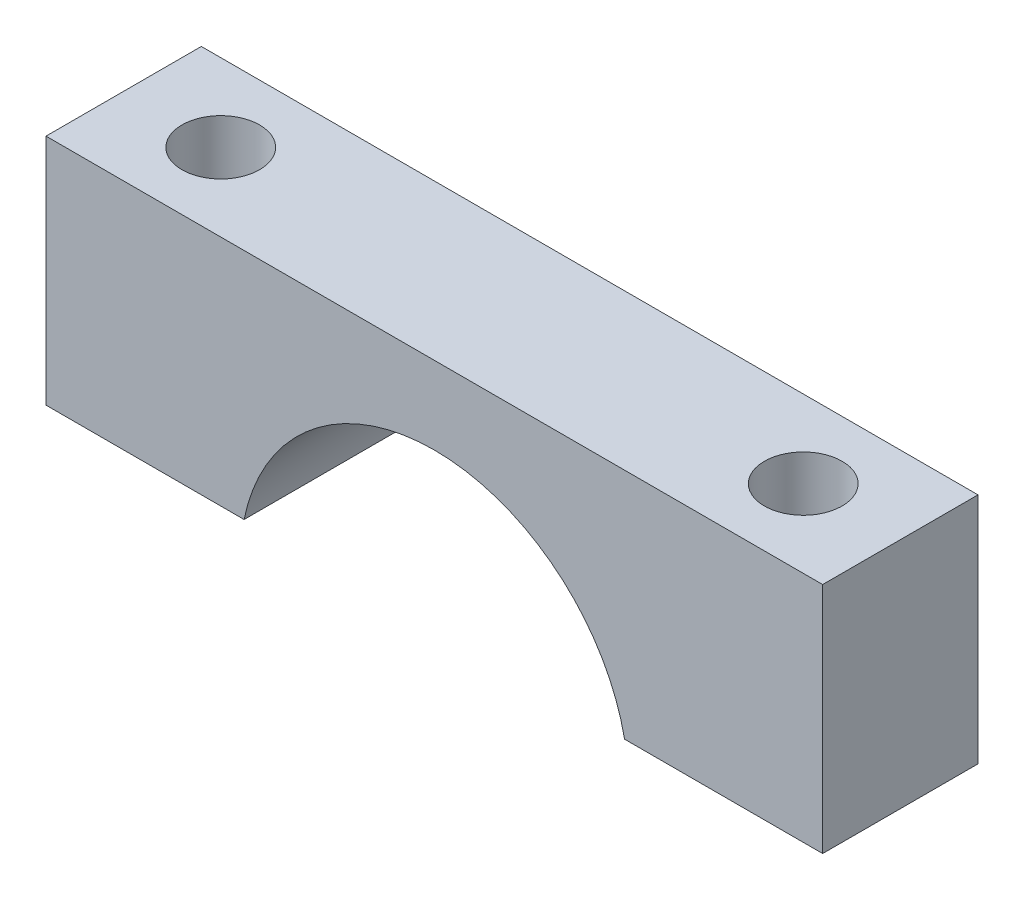
ISO-10303-21;
HEADER;
FILE_DESCRIPTION(('STEP AP214'),'2;1');
FILE_NAME('part.step','',(''),(''),'','','');
FILE_SCHEMA(('AUTOMOTIVE_DESIGN { 1 0 10303 214 1 1 1 1 }'));
ENDSEC;
DATA;
#1=APPLICATION_CONTEXT('core data for automotive mechanical design processes');
#2=APPLICATION_PROTOCOL_DEFINITION('international standard','automotive_design',2000,#1);
#3=PRODUCT_CONTEXT('',#1,'mechanical');
#4=PRODUCT('Part','Part','',(#3));
#5=PRODUCT_RELATED_PRODUCT_CATEGORY('part','',(#4));
#6=PRODUCT_DEFINITION_FORMATION('','',#4);
#7=PRODUCT_DEFINITION_CONTEXT('part definition',#1,'design');
#8=PRODUCT_DEFINITION('design','',#6,#7);
#9=PRODUCT_DEFINITION_SHAPE('','',#8);
#10=(LENGTH_UNIT() NAMED_UNIT(*) SI_UNIT(.MILLI.,.METRE.));
#11=(NAMED_UNIT(*) PLANE_ANGLE_UNIT() SI_UNIT($,.RADIAN.));
#12=(NAMED_UNIT(*) SI_UNIT($,.STERADIAN.) SOLID_ANGLE_UNIT());
#13=UNCERTAINTY_MEASURE_WITH_UNIT(LENGTH_MEASURE(1.E-05),#10,'distance_accuracy_value','');
#14=(GEOMETRIC_REPRESENTATION_CONTEXT(3) GLOBAL_UNCERTAINTY_ASSIGNED_CONTEXT((#13)) GLOBAL_UNIT_ASSIGNED_CONTEXT((#10,
#11,#12)) REPRESENTATION_CONTEXT('',''));
#15=CARTESIAN_POINT('',(0.,0.,0.));
#16=DIRECTION('',(0.,0.,1.));
#17=DIRECTION('',(1.,0.,0.));
#18=AXIS2_PLACEMENT_3D('',#15,#16,#17);
#19=CARTESIAN_POINT('',(4.89897948556636,-3.,4.));
#20=DIRECTION('',(0.,1.,0.));
#21=DIRECTION('',(-1.,0.,0.));
#22=AXIS2_PLACEMENT_3D('',#19,#20,#21);
#23=PLANE('',#22);
#24=DIRECTION('',(1.,0.,0.));
#25=VECTOR('',#24,1.);
#26=CARTESIAN_POINT('',(4.89897948556636,-3.,0.));
#27=LINE('',#26,#25);
#28=CARTESIAN_POINT('',(4.89897948556636,-3.,0.));
#29=VERTEX_POINT('',#28);
#30=CARTESIAN_POINT('',(10.,-3.,0.));
#31=VERTEX_POINT('',#30);
#32=EDGE_CURVE('E106',#29,#31,#27,.T.);
#33=ORIENTED_EDGE('',*,*,#32,.T.);
#34=DIRECTION('',(0.,0.,-1.));
#35=VECTOR('',#34,1.);
#36=CARTESIAN_POINT('',(10.,-3.,4.));
#37=LINE('',#36,#35);
#38=CARTESIAN_POINT('',(10.,-3.,4.));
#39=VERTEX_POINT('',#38);
#40=EDGE_CURVE('E103',#39,#31,#37,.T.);
#41=ORIENTED_EDGE('',*,*,#40,.F.);
#42=DIRECTION('',(1.,0.,0.));
#43=VECTOR('',#42,1.);
#44=CARTESIAN_POINT('',(4.89897948556636,-3.,4.));
#45=LINE('',#44,#43);
#46=CARTESIAN_POINT('',(4.89897948556636,-3.,4.));
#47=VERTEX_POINT('',#46);
#48=EDGE_CURVE('E92',#47,#39,#45,.T.);
#49=ORIENTED_EDGE('',*,*,#48,.F.);
#50=DIRECTION('',(0.,0.,-1.));
#51=VECTOR('',#50,1.);
#52=CARTESIAN_POINT('',(4.89897948556636,-3.,4.));
#53=LINE('',#52,#51);
#54=EDGE_CURVE('E107',#47,#29,#53,.T.);
#55=ORIENTED_EDGE('',*,*,#54,.T.);
#56=EDGE_LOOP('',(#33,#41,#49,#55));
#57=FACE_BOUND('',#56,.T.);
#58=CARTESIAN_POINT('',(7.5,-3.,2.));
#59=DIRECTION('',(0.,1.,0.));
#60=DIRECTION('',(0.,0.,-1.));
#61=AXIS2_PLACEMENT_3D('',#58,#59,#60);
#62=CIRCLE('',#61,1.);
#63=CARTESIAN_POINT('',(7.5,-3.,1.));
#64=VERTEX_POINT('',#63);
#65=EDGE_CURVE('E152',#64,#64,#62,.T.);
#66=ORIENTED_EDGE('',*,*,#65,.T.);
#67=EDGE_LOOP('',(#66));
#68=FACE_BOUND('',#67,.T.);
#69=ADVANCED_FACE('F31',(#57,#68),#23,.F.);
#70=CARTESIAN_POINT('',(-10.,3.,4.));
#71=DIRECTION('',(0.,-1.,0.));
#72=DIRECTION('',(0.,0.,-1.));
#73=AXIS2_PLACEMENT_3D('',#70,#71,#72);
#74=PLANE('',#73);
#75=DIRECTION('',(-1.,0.,0.));
#76=VECTOR('',#75,1.);
#77=CARTESIAN_POINT('',(-10.,3.,0.));
#78=LINE('',#77,#76);
#79=CARTESIAN_POINT('',(10.,3.,0.));
#80=VERTEX_POINT('',#79);
#81=CARTESIAN_POINT('',(-10.,3.,0.));
#82=VERTEX_POINT('',#81);
#83=EDGE_CURVE('E77',#80,#82,#78,.T.);
#84=ORIENTED_EDGE('',*,*,#83,.T.);
#85=DIRECTION('',(0.,0.,-1.));
#86=VECTOR('',#85,1.);
#87=CARTESIAN_POINT('',(-10.,3.,4.));
#88=LINE('',#87,#86);
#89=CARTESIAN_POINT('',(-10.,3.,4.));
#90=VERTEX_POINT('',#89);
#91=EDGE_CURVE('E112',#90,#82,#88,.T.);
#92=ORIENTED_EDGE('',*,*,#91,.F.);
#93=DIRECTION('',(-1.,0.,0.));
#94=VECTOR('',#93,1.);
#95=CARTESIAN_POINT('',(-10.,3.,4.));
#96=LINE('',#95,#94);
#97=CARTESIAN_POINT('',(10.,3.,4.));
#98=VERTEX_POINT('',#97);
#99=EDGE_CURVE('E48',#98,#90,#96,.T.);
#100=ORIENTED_EDGE('',*,*,#99,.F.);
#101=DIRECTION('',(0.,0.,-1.));
#102=VECTOR('',#101,1.);
#103=CARTESIAN_POINT('',(10.,3.,4.));
#104=LINE('',#103,#102);
#105=EDGE_CURVE('E108',#98,#80,#104,.T.);
#106=ORIENTED_EDGE('',*,*,#105,.T.);
#107=EDGE_LOOP('',(#84,#92,#100,#106));
#108=FACE_BOUND('',#107,.T.);
#109=CARTESIAN_POINT('',(-7.5,3.,2.));
#110=DIRECTION('',(0.,-1.,0.));
#111=DIRECTION('',(0.,0.,-1.));
#112=AXIS2_PLACEMENT_3D('',#109,#110,#111);
#113=CIRCLE('',#112,1.);
#114=CARTESIAN_POINT('',(-7.5,3.,1.));
#115=VERTEX_POINT('',#114);
#116=EDGE_CURVE('E120',#115,#115,#113,.T.);
#117=ORIENTED_EDGE('',*,*,#116,.T.);
#118=EDGE_LOOP('',(#117));
#119=FACE_BOUND('',#118,.T.);
#120=CARTESIAN_POINT('',(7.5,3.,2.));
#121=DIRECTION('',(0.,1.,0.));
#122=DIRECTION('',(0.,0.,-1.));
#123=AXIS2_PLACEMENT_3D('',#120,#121,#122);
#124=CIRCLE('',#123,1.);
#125=CARTESIAN_POINT('',(7.5,3.,1.));
#126=VERTEX_POINT('',#125);
#127=EDGE_CURVE('E149',#126,#126,#124,.T.);
#128=ORIENTED_EDGE('',*,*,#127,.F.);
#129=EDGE_LOOP('',(#128));
#130=FACE_BOUND('',#129,.T.);
#131=ADVANCED_FACE('F140',(#108,#119,#130),#74,.F.);
#132=CARTESIAN_POINT('',(-10.,3.,4.));
#133=DIRECTION('',(1.,0.,0.));
#134=DIRECTION('',(0.,0.,-1.));
#135=AXIS2_PLACEMENT_3D('',#132,#133,#134);
#136=PLANE('',#135);
#137=DIRECTION('',(0.,-1.,0.));
#138=VECTOR('',#137,1.);
#139=CARTESIAN_POINT('',(-10.,3.,0.));
#140=LINE('',#139,#138);
#141=CARTESIAN_POINT('',(-10.,-3.,0.));
#142=VERTEX_POINT('',#141);
#143=EDGE_CURVE('E116',#82,#142,#140,.T.);
#144=ORIENTED_EDGE('',*,*,#143,.T.);
#145=DIRECTION('',(0.,0.,-1.));
#146=VECTOR('',#145,1.);
#147=CARTESIAN_POINT('',(-10.,-3.,4.));
#148=LINE('',#147,#146);
#149=CARTESIAN_POINT('',(-10.,-3.,4.));
#150=VERTEX_POINT('',#149);
#151=EDGE_CURVE('E11',#150,#142,#148,.T.);
#152=ORIENTED_EDGE('',*,*,#151,.F.);
#153=DIRECTION('',(0.,-1.,0.));
#154=VECTOR('',#153,1.);
#155=CARTESIAN_POINT('',(-10.,3.,4.));
#156=LINE('',#155,#154);
#157=EDGE_CURVE('E127',#90,#150,#156,.T.);
#158=ORIENTED_EDGE('',*,*,#157,.F.);
#159=ORIENTED_EDGE('',*,*,#91,.T.);
#160=EDGE_LOOP('',(#144,#152,#158,#159));
#161=FACE_BOUND('',#160,.T.);
#162=ADVANCED_FACE('F33',(#161),#136,.F.);
#163=CARTESIAN_POINT('',(-10.,-3.,4.));
#164=DIRECTION('',(0.,1.,0.));
#165=DIRECTION('',(0.,0.,1.));
#166=AXIS2_PLACEMENT_3D('',#163,#164,#165);
#167=PLANE('',#166);
#168=CARTESIAN_POINT('',(-7.5,-3.,2.));
#169=DIRECTION('',(0.,-1.,0.));
#170=DIRECTION('',(0.,0.,-1.));
#171=AXIS2_PLACEMENT_3D('',#168,#169,#170);
#172=CIRCLE('',#171,1.);
#173=CARTESIAN_POINT('',(-7.5,-3.,1.));
#174=VERTEX_POINT('',#173);
#175=EDGE_CURVE('E151',#174,#174,#172,.T.);
#176=ORIENTED_EDGE('',*,*,#175,.F.);
#177=EDGE_LOOP('',(#176));
#178=FACE_BOUND('',#177,.T.);
#179=DIRECTION('',(1.,0.,0.));
#180=VECTOR('',#179,1.);
#181=CARTESIAN_POINT('',(-10.,-3.,0.));
#182=LINE('',#181,#180);
#183=CARTESIAN_POINT('',(-4.89897948556636,-3.,0.));
#184=VERTEX_POINT('',#183);
#185=EDGE_CURVE('E119',#142,#184,#182,.T.);
#186=ORIENTED_EDGE('',*,*,#185,.T.);
#187=DIRECTION('',(0.,0.,-1.));
#188=VECTOR('',#187,1.);
#189=CARTESIAN_POINT('',(-4.89897948556636,-3.,4.));
#190=LINE('',#189,#188);
#191=CARTESIAN_POINT('',(-4.89897948556636,-3.,4.));
#192=VERTEX_POINT('',#191);
#193=EDGE_CURVE('E40',#192,#184,#190,.T.);
#194=ORIENTED_EDGE('',*,*,#193,.F.);
#195=DIRECTION('',(1.,0.,0.));
#196=VECTOR('',#195,1.);
#197=CARTESIAN_POINT('',(-10.,-3.,4.));
#198=LINE('',#197,#196);
#199=EDGE_CURVE('E85',#150,#192,#198,.T.);
#200=ORIENTED_EDGE('',*,*,#199,.F.);
#201=ORIENTED_EDGE('',*,*,#151,.T.);
#202=EDGE_LOOP('',(#186,#194,#200,#201));
#203=FACE_BOUND('',#202,.T.);
#204=ADVANCED_FACE('F179',(#178,#203),#167,.F.);
#205=CARTESIAN_POINT('',(0.,-4.,4.));
#206=DIRECTION('',(0.,0.,-1.));
#207=DIRECTION('',(-1.,0.,0.));
#208=AXIS2_PLACEMENT_3D('',#205,#206,#207);
#209=CYLINDRICAL_SURFACE('',#208,5.);
#210=CARTESIAN_POINT('',(0.,-4.,0.));
#211=DIRECTION('',(0.,0.,-1.));
#212=DIRECTION('',(1.,0.,0.));
#213=AXIS2_PLACEMENT_3D('',#210,#211,#212);
#214=CIRCLE('',#213,5.);
#215=EDGE_CURVE('E122',#184,#29,#214,.T.);
#216=ORIENTED_EDGE('',*,*,#215,.T.);
#217=ORIENTED_EDGE('',*,*,#54,.F.);
#218=CARTESIAN_POINT('',(0.,-4.,4.));
#219=DIRECTION('',(0.,0.,-1.));
#220=DIRECTION('',(1.,0.,0.));
#221=AXIS2_PLACEMENT_3D('',#218,#219,#220);
#222=CIRCLE('',#221,5.);
#223=EDGE_CURVE('E98',#192,#47,#222,.T.);
#224=ORIENTED_EDGE('',*,*,#223,.F.);
#225=ORIENTED_EDGE('',*,*,#193,.T.);
#226=EDGE_LOOP('',(#216,#217,#224,#225));
#227=FACE_BOUND('',#226,.T.);
#228=ADVANCED_FACE('F133',(#227),#209,.F.);
#229=CARTESIAN_POINT('',(10.,3.,4.));
#230=DIRECTION('',(-1.,0.,0.));
#231=DIRECTION('',(0.,0.,1.));
#232=AXIS2_PLACEMENT_3D('',#229,#230,#231);
#233=PLANE('',#232);
#234=DIRECTION('',(0.,1.,0.));
#235=VECTOR('',#234,1.);
#236=CARTESIAN_POINT('',(10.,3.,0.));
#237=LINE('',#236,#235);
#238=EDGE_CURVE('E71',#31,#80,#237,.T.);
#239=ORIENTED_EDGE('',*,*,#238,.T.);
#240=ORIENTED_EDGE('',*,*,#105,.F.);
#241=DIRECTION('',(0.,1.,0.));
#242=VECTOR('',#241,1.);
#243=CARTESIAN_POINT('',(10.,3.,4.));
#244=LINE('',#243,#242);
#245=EDGE_CURVE('E96',#39,#98,#244,.T.);
#246=ORIENTED_EDGE('',*,*,#245,.F.);
#247=ORIENTED_EDGE('',*,*,#40,.T.);
#248=EDGE_LOOP('',(#239,#240,#246,#247));
#249=FACE_BOUND('',#248,.T.);
#250=ADVANCED_FACE('F110',(#249),#233,.F.);
#251=CARTESIAN_POINT('',(0.,-4.,4.));
#252=DIRECTION('',(0.,0.,1.));
#253=DIRECTION('',(1.,0.,0.));
#254=AXIS2_PLACEMENT_3D('',#251,#252,#253);
#255=PLANE('',#254);
#256=ORIENTED_EDGE('',*,*,#157,.T.);
#257=ORIENTED_EDGE('',*,*,#199,.T.);
#258=ORIENTED_EDGE('',*,*,#223,.T.);
#259=ORIENTED_EDGE('',*,*,#48,.T.);
#260=ORIENTED_EDGE('',*,*,#245,.T.);
#261=ORIENTED_EDGE('',*,*,#99,.T.);
#262=EDGE_LOOP('',(#256,#257,#258,#259,#260,#261));
#263=FACE_BOUND('',#262,.T.);
#264=ADVANCED_FACE('F94',(#263),#255,.T.);
#265=CARTESIAN_POINT('',(0.,-4.,0.));
#266=DIRECTION('',(0.,0.,1.));
#267=DIRECTION('',(1.,0.,0.));
#268=AXIS2_PLACEMENT_3D('',#265,#266,#267);
#269=PLANE('',#268);
#270=ORIENTED_EDGE('',*,*,#143,.F.);
#271=ORIENTED_EDGE('',*,*,#83,.F.);
#272=ORIENTED_EDGE('',*,*,#238,.F.);
#273=ORIENTED_EDGE('',*,*,#32,.F.);
#274=ORIENTED_EDGE('',*,*,#215,.F.);
#275=ORIENTED_EDGE('',*,*,#185,.F.);
#276=EDGE_LOOP('',(#270,#271,#272,#273,#274,#275));
#277=FACE_BOUND('',#276,.T.);
#278=ADVANCED_FACE('F136',(#277),#269,.F.);
#279=CARTESIAN_POINT('',(-7.5,3.,2.));
#280=DIRECTION('',(0.,-1.,0.));
#281=DIRECTION('',(0.,0.,-1.));
#282=AXIS2_PLACEMENT_3D('',#279,#280,#281);
#283=CYLINDRICAL_SURFACE('',#282,1.);
#284=ORIENTED_EDGE('',*,*,#116,.F.);
#285=EDGE_LOOP('',(#284));
#286=FACE_BOUND('',#285,.T.);
#287=ORIENTED_EDGE('',*,*,#175,.T.);
#288=EDGE_LOOP('',(#287));
#289=FACE_BOUND('',#288,.T.);
#290=ADVANCED_FACE('F165',(#286,#289),#283,.F.);
#291=CARTESIAN_POINT('',(7.5,3.,2.));
#292=DIRECTION('',(0.,-1.,0.));
#293=DIRECTION('',(0.,0.,-1.));
#294=AXIS2_PLACEMENT_3D('',#291,#292,#293);
#295=CYLINDRICAL_SURFACE('',#294,1.);
#296=ORIENTED_EDGE('',*,*,#127,.T.);
#297=EDGE_LOOP('',(#296));
#298=FACE_BOUND('',#297,.T.);
#299=ORIENTED_EDGE('',*,*,#65,.F.);
#300=EDGE_LOOP('',(#299));
#301=FACE_BOUND('',#300,.T.);
#302=ADVANCED_FACE('F163',(#298,#301),#295,.F.);
#303=CLOSED_SHELL('',(#69,#131,#162,#204,#228,#250,#264,#278,#290,#302));
#304=MANIFOLD_SOLID_BREP('B2',#303);
#305=ADVANCED_BREP_SHAPE_REPRESENTATION('',(#18,#304),#14);
#306=SHAPE_DEFINITION_REPRESENTATION(#9,#305);
ENDSEC;
END-ISO-10303-21;
